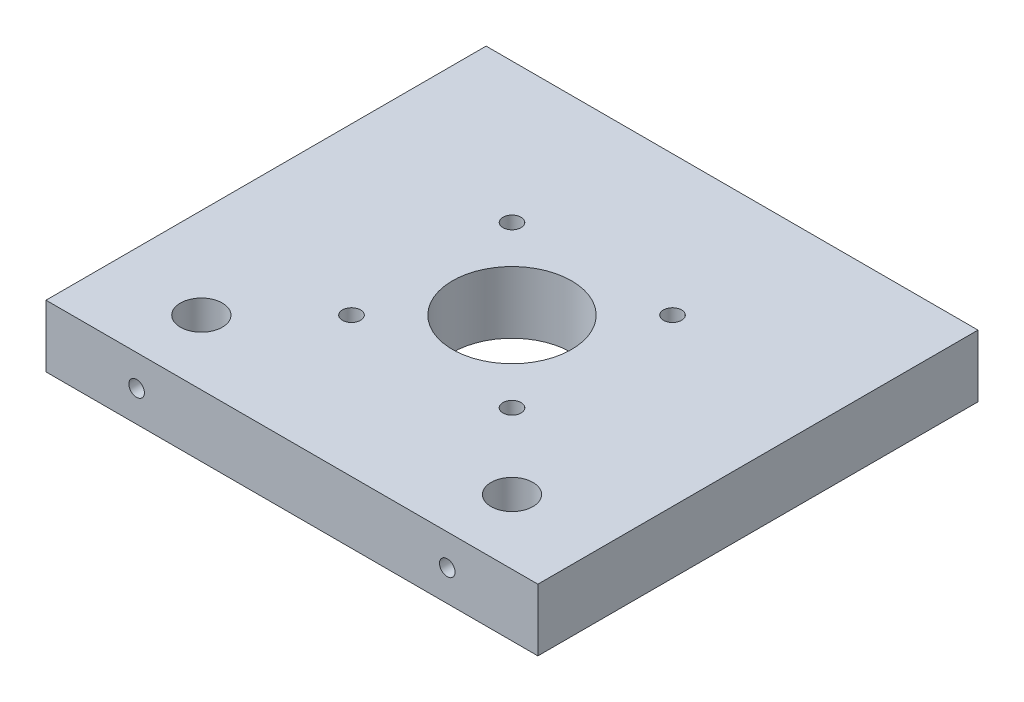
ISO-10303-21;
HEADER;
FILE_DESCRIPTION(('STEP AP214'),'2;1');
FILE_NAME('part.step','',(''),(''),'','','');
FILE_SCHEMA(('AUTOMOTIVE_DESIGN { 1 0 10303 214 1 1 1 1 }'));
ENDSEC;
DATA;
#1=APPLICATION_CONTEXT('core data for automotive mechanical design processes');
#2=APPLICATION_PROTOCOL_DEFINITION('international standard','automotive_design',2000,#1);
#3=PRODUCT_CONTEXT('',#1,'mechanical');
#4=PRODUCT('Part','Part','',(#3));
#5=PRODUCT_RELATED_PRODUCT_CATEGORY('part','',(#4));
#6=PRODUCT_DEFINITION_FORMATION('','',#4);
#7=PRODUCT_DEFINITION_CONTEXT('part definition',#1,'design');
#8=PRODUCT_DEFINITION('design','',#6,#7);
#9=PRODUCT_DEFINITION_SHAPE('','',#8);
#10=(LENGTH_UNIT() NAMED_UNIT(*) SI_UNIT(.MILLI.,.METRE.));
#11=(NAMED_UNIT(*) PLANE_ANGLE_UNIT() SI_UNIT($,.RADIAN.));
#12=(NAMED_UNIT(*) SI_UNIT($,.STERADIAN.) SOLID_ANGLE_UNIT());
#13=UNCERTAINTY_MEASURE_WITH_UNIT(LENGTH_MEASURE(1.E-05),#10,'distance_accuracy_value','');
#14=(GEOMETRIC_REPRESENTATION_CONTEXT(3) GLOBAL_UNCERTAINTY_ASSIGNED_CONTEXT((#13)) GLOBAL_UNIT_ASSIGNED_CONTEXT((#10,
#11,#12)) REPRESENTATION_CONTEXT('',''));
#15=CARTESIAN_POINT('',(0.,0.,0.));
#16=DIRECTION('',(0.,0.,1.));
#17=DIRECTION('',(1.,0.,0.));
#18=AXIS2_PLACEMENT_3D('',#15,#16,#17);
#19=CARTESIAN_POINT('',(47.5,6.,85.));
#20=DIRECTION('',(-1.,0.,0.));
#21=DIRECTION('',(0.,0.,1.));
#22=AXIS2_PLACEMENT_3D('',#19,#20,#21);
#23=PLANE('',#22);
#24=DIRECTION('',(0.,1.,0.));
#25=VECTOR('',#24,1.);
#26=CARTESIAN_POINT('',(47.5,6.,0.));
#27=LINE('',#26,#25);
#28=CARTESIAN_POINT('',(47.5,-6.,0.));
#29=VERTEX_POINT('',#28);
#30=CARTESIAN_POINT('',(47.5,6.,0.));
#31=VERTEX_POINT('',#30);
#32=EDGE_CURVE('E96',#29,#31,#27,.T.);
#33=ORIENTED_EDGE('',*,*,#32,.T.);
#34=DIRECTION('',(0.,0.,-1.));
#35=VECTOR('',#34,1.);
#36=CARTESIAN_POINT('',(47.5,6.,85.));
#37=LINE('',#36,#35);
#38=CARTESIAN_POINT('',(47.5,6.,85.));
#39=VERTEX_POINT('',#38);
#40=EDGE_CURVE('E11',#39,#31,#37,.T.);
#41=ORIENTED_EDGE('',*,*,#40,.F.);
#42=DIRECTION('',(0.,1.,0.));
#43=VECTOR('',#42,1.);
#44=CARTESIAN_POINT('',(47.5,6.,85.));
#45=LINE('',#44,#43);
#46=CARTESIAN_POINT('',(47.5,-6.,85.));
#47=VERTEX_POINT('',#46);
#48=EDGE_CURVE('E84',#47,#39,#45,.T.);
#49=ORIENTED_EDGE('',*,*,#48,.F.);
#50=DIRECTION('',(0.,0.,-1.));
#51=VECTOR('',#50,1.);
#52=CARTESIAN_POINT('',(47.5,-6.,85.));
#53=LINE('',#52,#51);
#54=EDGE_CURVE('E92',#47,#29,#53,.T.);
#55=ORIENTED_EDGE('',*,*,#54,.T.);
#56=EDGE_LOOP('',(#33,#41,#49,#55));
#57=FACE_BOUND('',#56,.T.);
#58=ADVANCED_FACE('F33',(#57),#23,.F.);
#59=CARTESIAN_POINT('',(-47.5,6.,85.));
#60=DIRECTION('',(0.,-1.,0.));
#61=DIRECTION('',(0.,0.,-1.));
#62=AXIS2_PLACEMENT_3D('',#59,#60,#61);
#63=PLANE('',#62);
#64=CARTESIAN_POINT('',(15.5,6.,27.));
#65=DIRECTION('',(0.,-1.,0.));
#66=DIRECTION('',(0.,0.,-1.));
#67=AXIS2_PLACEMENT_3D('',#64,#65,#66);
#68=CIRCLE('',#67,1.75);
#69=CARTESIAN_POINT('',(15.5,6.,25.25));
#70=VERTEX_POINT('',#69);
#71=EDGE_CURVE('E173',#70,#70,#68,.T.);
#72=ORIENTED_EDGE('',*,*,#71,.T.);
#73=EDGE_LOOP('',(#72));
#74=FACE_BOUND('',#73,.T.);
#75=CARTESIAN_POINT('',(15.5,6.,58.));
#76=DIRECTION('',(0.,-1.,0.));
#77=DIRECTION('',(0.,0.,-1.));
#78=AXIS2_PLACEMENT_3D('',#75,#76,#77);
#79=CIRCLE('',#78,1.75);
#80=CARTESIAN_POINT('',(15.5,6.,56.25));
#81=VERTEX_POINT('',#80);
#82=EDGE_CURVE('E167',#81,#81,#79,.T.);
#83=ORIENTED_EDGE('',*,*,#82,.T.);
#84=EDGE_LOOP('',(#83));
#85=FACE_BOUND('',#84,.T.);
#86=CARTESIAN_POINT('',(-15.5,6.,27.));
#87=DIRECTION('',(0.,-1.,0.));
#88=DIRECTION('',(0.,0.,-1.));
#89=AXIS2_PLACEMENT_3D('',#86,#87,#88);
#90=CIRCLE('',#89,1.75);
#91=CARTESIAN_POINT('',(-15.5,6.,25.25));
#92=VERTEX_POINT('',#91);
#93=EDGE_CURVE('E161',#92,#92,#90,.T.);
#94=ORIENTED_EDGE('',*,*,#93,.T.);
#95=EDGE_LOOP('',(#94));
#96=FACE_BOUND('',#95,.T.);
#97=CARTESIAN_POINT('',(-15.5,6.,58.));
#98=DIRECTION('',(0.,-1.,0.));
#99=DIRECTION('',(0.,0.,-1.));
#100=AXIS2_PLACEMENT_3D('',#97,#98,#99);
#101=CIRCLE('',#100,1.75);
#102=CARTESIAN_POINT('',(-15.5,6.,56.25));
#103=VERTEX_POINT('',#102);
#104=EDGE_CURVE('E157',#103,#103,#101,.T.);
#105=ORIENTED_EDGE('',*,*,#104,.T.);
#106=EDGE_LOOP('',(#105));
#107=FACE_BOUND('',#106,.T.);
#108=CARTESIAN_POINT('',(0.,6.,42.5));
#109=DIRECTION('',(0.,-1.,0.));
#110=DIRECTION('',(0.,0.,-1.));
#111=AXIS2_PLACEMENT_3D('',#108,#109,#110);
#112=CIRCLE('',#111,11.5);
#113=CARTESIAN_POINT('',(0.,6.,31.));
#114=VERTEX_POINT('',#113);
#115=EDGE_CURVE('E119',#114,#114,#112,.T.);
#116=ORIENTED_EDGE('',*,*,#115,.T.);
#117=EDGE_LOOP('',(#116));
#118=FACE_BOUND('',#117,.T.);
#119=CARTESIAN_POINT('',(30.,6.,72.5));
#120=DIRECTION('',(0.,-1.,0.));
#121=DIRECTION('',(0.,0.,-1.));
#122=AXIS2_PLACEMENT_3D('',#119,#120,#121);
#123=CIRCLE('',#122,4.05);
#124=CARTESIAN_POINT('',(30.,6.,68.45));
#125=VERTEX_POINT('',#124);
#126=EDGE_CURVE('E113',#125,#125,#123,.T.);
#127=ORIENTED_EDGE('',*,*,#126,.T.);
#128=EDGE_LOOP('',(#127));
#129=FACE_BOUND('',#128,.T.);
#130=CARTESIAN_POINT('',(-30.,6.,72.5));
#131=DIRECTION('',(0.,-1.,0.));
#132=DIRECTION('',(0.,0.,-1.));
#133=AXIS2_PLACEMENT_3D('',#130,#131,#132);
#134=CIRCLE('',#133,4.05);
#135=CARTESIAN_POINT('',(-30.,6.,68.45));
#136=VERTEX_POINT('',#135);
#137=EDGE_CURVE('E99',#136,#136,#134,.T.);
#138=ORIENTED_EDGE('',*,*,#137,.T.);
#139=EDGE_LOOP('',(#138));
#140=FACE_BOUND('',#139,.T.);
#141=DIRECTION('',(-1.,0.,0.));
#142=VECTOR('',#141,1.);
#143=CARTESIAN_POINT('',(-47.5,6.,0.));
#144=LINE('',#143,#142);
#145=CARTESIAN_POINT('',(-47.5,6.,0.));
#146=VERTEX_POINT('',#145);
#147=EDGE_CURVE('E88',#31,#146,#144,.T.);
#148=ORIENTED_EDGE('',*,*,#147,.T.);
#149=DIRECTION('',(0.,0.,-1.));
#150=VECTOR('',#149,1.);
#151=CARTESIAN_POINT('',(-47.5,6.,85.));
#152=LINE('',#151,#150);
#153=CARTESIAN_POINT('',(-47.5,6.,85.));
#154=VERTEX_POINT('',#153);
#155=EDGE_CURVE('E41',#154,#146,#152,.T.);
#156=ORIENTED_EDGE('',*,*,#155,.F.);
#157=DIRECTION('',(-1.,0.,0.));
#158=VECTOR('',#157,1.);
#159=CARTESIAN_POINT('',(-47.5,6.,85.));
#160=LINE('',#159,#158);
#161=EDGE_CURVE('E79',#39,#154,#160,.T.);
#162=ORIENTED_EDGE('',*,*,#161,.F.);
#163=ORIENTED_EDGE('',*,*,#40,.T.);
#164=EDGE_LOOP('',(#148,#156,#162,#163));
#165=FACE_BOUND('',#164,.T.);
#166=ADVANCED_FACE('F87',(#74,#85,#96,#107,#118,#129,#140,#165),#63,.F.);
#167=CARTESIAN_POINT('',(-47.5,6.,85.));
#168=DIRECTION('',(1.,0.,0.));
#169=DIRECTION('',(0.,1.,0.));
#170=AXIS2_PLACEMENT_3D('',#167,#168,#169);
#171=PLANE('',#170);
#172=DIRECTION('',(0.,-1.,0.));
#173=VECTOR('',#172,1.);
#174=CARTESIAN_POINT('',(-47.5,6.,0.));
#175=LINE('',#174,#173);
#176=CARTESIAN_POINT('',(-47.5,-6.,0.));
#177=VERTEX_POINT('',#176);
#178=EDGE_CURVE('E66',#146,#177,#175,.T.);
#179=ORIENTED_EDGE('',*,*,#178,.T.);
#180=DIRECTION('',(0.,0.,-1.));
#181=VECTOR('',#180,1.);
#182=CARTESIAN_POINT('',(-47.5,-6.,85.));
#183=LINE('',#182,#181);
#184=CARTESIAN_POINT('',(-47.5,-6.,85.));
#185=VERTEX_POINT('',#184);
#186=EDGE_CURVE('E89',#185,#177,#183,.T.);
#187=ORIENTED_EDGE('',*,*,#186,.F.);
#188=DIRECTION('',(0.,-1.,0.));
#189=VECTOR('',#188,1.);
#190=CARTESIAN_POINT('',(-47.5,6.,85.));
#191=LINE('',#190,#189);
#192=EDGE_CURVE('E82',#154,#185,#191,.T.);
#193=ORIENTED_EDGE('',*,*,#192,.F.);
#194=ORIENTED_EDGE('',*,*,#155,.T.);
#195=EDGE_LOOP('',(#179,#187,#193,#194));
#196=FACE_BOUND('',#195,.T.);
#197=ADVANCED_FACE('F90',(#196),#171,.F.);
#198=CARTESIAN_POINT('',(-47.5,-6.,85.));
#199=DIRECTION('',(0.,1.,0.));
#200=DIRECTION('',(0.,0.,1.));
#201=AXIS2_PLACEMENT_3D('',#198,#199,#200);
#202=PLANE('',#201);
#203=CARTESIAN_POINT('',(15.5,-6.,27.));
#204=DIRECTION('',(0.,-1.,0.));
#205=DIRECTION('',(0.,0.,-1.));
#206=AXIS2_PLACEMENT_3D('',#203,#204,#205);
#207=CIRCLE('',#206,1.75);
#208=CARTESIAN_POINT('',(15.5,-6.,25.25));
#209=VERTEX_POINT('',#208);
#210=EDGE_CURVE('E176',#209,#209,#207,.T.);
#211=ORIENTED_EDGE('',*,*,#210,.F.);
#212=EDGE_LOOP('',(#211));
#213=FACE_BOUND('',#212,.T.);
#214=CARTESIAN_POINT('',(15.5,-6.,58.));
#215=DIRECTION('',(0.,-1.,0.));
#216=DIRECTION('',(0.,0.,-1.));
#217=AXIS2_PLACEMENT_3D('',#214,#215,#216);
#218=CIRCLE('',#217,1.75);
#219=CARTESIAN_POINT('',(15.5,-6.,56.25));
#220=VERTEX_POINT('',#219);
#221=EDGE_CURVE('E170',#220,#220,#218,.T.);
#222=ORIENTED_EDGE('',*,*,#221,.F.);
#223=EDGE_LOOP('',(#222));
#224=FACE_BOUND('',#223,.T.);
#225=CARTESIAN_POINT('',(-15.5,-6.,27.));
#226=DIRECTION('',(0.,-1.,0.));
#227=DIRECTION('',(0.,0.,-1.));
#228=AXIS2_PLACEMENT_3D('',#225,#226,#227);
#229=CIRCLE('',#228,1.75);
#230=CARTESIAN_POINT('',(-15.5,-6.,25.25));
#231=VERTEX_POINT('',#230);
#232=EDGE_CURVE('E164',#231,#231,#229,.T.);
#233=ORIENTED_EDGE('',*,*,#232,.F.);
#234=EDGE_LOOP('',(#233));
#235=FACE_BOUND('',#234,.T.);
#236=CARTESIAN_POINT('',(-15.5,-6.,58.));
#237=DIRECTION('',(0.,-1.,0.));
#238=DIRECTION('',(0.,0.,-1.));
#239=AXIS2_PLACEMENT_3D('',#236,#237,#238);
#240=CIRCLE('',#239,1.75);
#241=CARTESIAN_POINT('',(-15.5,-6.,56.25));
#242=VERTEX_POINT('',#241);
#243=EDGE_CURVE('E158',#242,#242,#240,.T.);
#244=ORIENTED_EDGE('',*,*,#243,.F.);
#245=EDGE_LOOP('',(#244));
#246=FACE_BOUND('',#245,.T.);
#247=CARTESIAN_POINT('',(0.,-6.,42.5));
#248=DIRECTION('',(0.,-1.,0.));
#249=DIRECTION('',(0.,0.,-1.));
#250=AXIS2_PLACEMENT_3D('',#247,#248,#249);
#251=CIRCLE('',#250,11.5);
#252=CARTESIAN_POINT('',(0.,-6.,31.));
#253=VERTEX_POINT('',#252);
#254=EDGE_CURVE('E122',#253,#253,#251,.T.);
#255=ORIENTED_EDGE('',*,*,#254,.F.);
#256=EDGE_LOOP('',(#255));
#257=FACE_BOUND('',#256,.T.);
#258=CARTESIAN_POINT('',(30.,-6.,72.5));
#259=DIRECTION('',(0.,-1.,0.));
#260=DIRECTION('',(0.,0.,-1.));
#261=AXIS2_PLACEMENT_3D('',#258,#259,#260);
#262=CIRCLE('',#261,4.05);
#263=CARTESIAN_POINT('',(30.,-6.,68.45));
#264=VERTEX_POINT('',#263);
#265=EDGE_CURVE('E116',#264,#264,#262,.T.);
#266=ORIENTED_EDGE('',*,*,#265,.F.);
#267=EDGE_LOOP('',(#266));
#268=FACE_BOUND('',#267,.T.);
#269=CARTESIAN_POINT('',(-30.,-6.,72.5));
#270=DIRECTION('',(0.,-1.,0.));
#271=DIRECTION('',(0.,0.,-1.));
#272=AXIS2_PLACEMENT_3D('',#269,#270,#271);
#273=CIRCLE('',#272,4.05);
#274=CARTESIAN_POINT('',(-30.,-6.,68.45));
#275=VERTEX_POINT('',#274);
#276=EDGE_CURVE('E110',#275,#275,#273,.T.);
#277=ORIENTED_EDGE('',*,*,#276,.F.);
#278=EDGE_LOOP('',(#277));
#279=FACE_BOUND('',#278,.T.);
#280=DIRECTION('',(1.,0.,0.));
#281=VECTOR('',#280,1.);
#282=CARTESIAN_POINT('',(-47.5,-6.,0.));
#283=LINE('',#282,#281);
#284=EDGE_CURVE('E72',#177,#29,#283,.T.);
#285=ORIENTED_EDGE('',*,*,#284,.T.);
#286=ORIENTED_EDGE('',*,*,#54,.F.);
#287=DIRECTION('',(1.,0.,0.));
#288=VECTOR('',#287,1.);
#289=CARTESIAN_POINT('',(-47.5,-6.,85.));
#290=LINE('',#289,#288);
#291=EDGE_CURVE('E49',#185,#47,#290,.T.);
#292=ORIENTED_EDGE('',*,*,#291,.F.);
#293=ORIENTED_EDGE('',*,*,#186,.T.);
#294=EDGE_LOOP('',(#285,#286,#292,#293));
#295=FACE_BOUND('',#294,.T.);
#296=ADVANCED_FACE('F104',(#213,#224,#235,#246,#257,#268,#279,#295),#202,.F.);
#297=CARTESIAN_POINT('',(0.,0.,85.));
#298=DIRECTION('',(0.,0.,1.));
#299=DIRECTION('',(1.,0.,0.));
#300=AXIS2_PLACEMENT_3D('',#297,#298,#299);
#301=PLANE('',#300);
#302=CARTESIAN_POINT('',(-30.,0.,85.));
#303=DIRECTION('',(0.,0.,1.));
#304=DIRECTION('',(1.,0.,0.));
#305=AXIS2_PLACEMENT_3D('',#302,#303,#304);
#306=CIRCLE('',#305,1.5);
#307=CARTESIAN_POINT('',(-28.5,0.,85.));
#308=VERTEX_POINT('',#307);
#309=EDGE_CURVE('E137',#308,#308,#306,.T.);
#310=ORIENTED_EDGE('',*,*,#309,.F.);
#311=EDGE_LOOP('',(#310));
#312=FACE_BOUND('',#311,.T.);
#313=CARTESIAN_POINT('',(30.,0.,85.));
#314=DIRECTION('',(0.,0.,1.));
#315=DIRECTION('',(1.,0.,0.));
#316=AXIS2_PLACEMENT_3D('',#313,#314,#315);
#317=CIRCLE('',#316,1.5);
#318=CARTESIAN_POINT('',(31.5,0.,85.));
#319=VERTEX_POINT('',#318);
#320=EDGE_CURVE('E125',#319,#319,#317,.T.);
#321=ORIENTED_EDGE('',*,*,#320,.F.);
#322=EDGE_LOOP('',(#321));
#323=FACE_BOUND('',#322,.T.);
#324=ORIENTED_EDGE('',*,*,#48,.T.);
#325=ORIENTED_EDGE('',*,*,#161,.T.);
#326=ORIENTED_EDGE('',*,*,#192,.T.);
#327=ORIENTED_EDGE('',*,*,#291,.T.);
#328=EDGE_LOOP('',(#324,#325,#326,#327));
#329=FACE_BOUND('',#328,.T.);
#330=ADVANCED_FACE('F80',(#312,#323,#329),#301,.T.);
#331=CARTESIAN_POINT('',(0.,0.,0.));
#332=DIRECTION('',(0.,0.,1.));
#333=DIRECTION('',(1.,0.,0.));
#334=AXIS2_PLACEMENT_3D('',#331,#332,#333);
#335=PLANE('',#334);
#336=ORIENTED_EDGE('',*,*,#32,.F.);
#337=ORIENTED_EDGE('',*,*,#284,.F.);
#338=ORIENTED_EDGE('',*,*,#178,.F.);
#339=ORIENTED_EDGE('',*,*,#147,.F.);
#340=EDGE_LOOP('',(#336,#337,#338,#339));
#341=FACE_BOUND('',#340,.T.);
#342=ADVANCED_FACE('F107',(#341),#335,.F.);
#343=CARTESIAN_POINT('',(-30.,6.,72.5));
#344=DIRECTION('',(0.,-1.,0.));
#345=DIRECTION('',(0.,0.,-1.));
#346=AXIS2_PLACEMENT_3D('',#343,#344,#345);
#347=CYLINDRICAL_SURFACE('',#346,4.05);
#348=CARTESIAN_POINT('',(-28.5,0.,76.2619808611953));
#349=CARTESIAN_POINT('',(-28.499997314737,-0.0810891334683263,76.2619783928045));
#350=CARTESIAN_POINT('',(-28.5065973592327,-0.162160309047721,76.2646311539495));
#351=CARTESIAN_POINT('',(-28.5327065737687,-0.321863243037455,76.274883341602));
#352=CARTESIAN_POINT('',(-28.5522156126098,-0.400495026231791,76.2824827178351));
#353=CARTESIAN_POINT('',(-28.6033328710849,-0.552970015146571,76.3016517492077));
#354=CARTESIAN_POINT('',(-28.6349127361642,-0.626823972244057,76.3132120934298));
#355=CARTESIAN_POINT('',(-28.7091751195573,-0.768213906906506,76.3389856745783));
#356=CARTESIAN_POINT('',(-28.7518608833474,-0.835748029769575,76.3531996866424));
#357=CARTESIAN_POINT('',(-28.8493389051183,-0.965853976219434,76.3834508721137));
#358=CARTESIAN_POINT('',(-28.9045816891257,-1.02807608539166,76.3995407791495));
#359=CARTESIAN_POINT('',(-29.0246490643916,-1.14261844136584,76.4312902576168));
#360=CARTESIAN_POINT('',(-29.089475630863,-1.19493664189611,76.4469497395469));
#361=CARTESIAN_POINT('',(-29.2295135857313,-1.28985913712174,76.4766988909703));
#362=CARTESIAN_POINT('',(-29.3049975451178,-1.33208488813537,76.4907195036974));
#363=CARTESIAN_POINT('',(-29.4626083653082,-1.40309423078099,76.5149787680496));
#364=CARTESIAN_POINT('',(-29.5447329720443,-1.43188236132632,76.5252186964565));
#365=CARTESIAN_POINT('',(-29.709618342132,-1.47397749136628,76.5403885855827));
#366=CARTESIAN_POINT('',(-29.792206189695,-1.48788621560969,76.545524285012));
#367=CARTESIAN_POINT('',(-29.9586927605687,-1.50175400860525,76.5506444800488));
#368=CARTESIAN_POINT('',(-30.0425910595962,-1.50171750246429,76.5506306097202));
#369=CARTESIAN_POINT('',(-30.2050102957497,-1.48804993868762,76.5455850984626));
#370=CARTESIAN_POINT('',(-30.2835952941982,-1.47507528246144,76.5407957372615));
#371=CARTESIAN_POINT('',(-30.4373815523277,-1.43700170605454,76.5270535664788));
#372=CARTESIAN_POINT('',(-30.5125825727121,-1.41190192991977,76.518100462966));
#373=CARTESIAN_POINT('',(-30.6587528013293,-1.34997692309171,76.4967591559646));
#374=CARTESIAN_POINT('',(-30.7296453075566,-1.31298775789584,76.4843232590446));
#375=CARTESIAN_POINT('',(-30.8643913706546,-1.22847777825054,76.4572790398247));
#376=CARTESIAN_POINT('',(-30.9282426783346,-1.1809536130839,76.44267002684));
#377=CARTESIAN_POINT('',(-31.0509658559265,-1.0735427882489,76.4118029818039));
#378=CARTESIAN_POINT('',(-31.1093439009455,-1.01310443474047,76.3954984243782));
#379=CARTESIAN_POINT('',(-31.2153190318627,-0.883192548762243,76.3637503957587));
#380=CARTESIAN_POINT('',(-31.2629135453125,-0.813716866615781,76.34830713069));
#381=CARTESIAN_POINT('',(-31.3468823649577,-0.665799377193902,76.3197412833271));
#382=CARTESIAN_POINT('',(-31.3829975968804,-0.587198797366458,76.3066747987483));
#383=CARTESIAN_POINT('',(-31.4412945922282,-0.424420518637647,76.2849899492638));
#384=CARTESIAN_POINT('',(-31.4634838805418,-0.340245858924454,76.2763691825625));
#385=CARTESIAN_POINT('',(-31.4921896715132,-0.173578841001167,76.2651157106558));
#386=CARTESIAN_POINT('',(-31.4994885862334,-0.0912415305431188,76.2621844890466));
#387=CARTESIAN_POINT('',(-31.500459045415,0.0735155840518162,76.261798113694));
#388=CARTESIAN_POINT('',(-31.4941338764604,0.155935363500273,76.2643416392585));
#389=CARTESIAN_POINT('',(-31.4687444769862,0.314559610163147,76.2743156093745));
#390=CARTESIAN_POINT('',(-31.4502776486839,0.390875782779827,76.2815166342019));
#391=CARTESIAN_POINT('',(-31.4018766861181,0.539293906964582,76.2997244024622));
#392=CARTESIAN_POINT('',(-31.3719402375325,0.611395004635053,76.3107319139182));
#393=CARTESIAN_POINT('',(-31.3002061083661,0.752291982132171,76.3358121007634));
#394=CARTESIAN_POINT('',(-31.2580117406083,0.820867931809038,76.349982838958));
#395=CARTESIAN_POINT('',(-31.1633846350649,0.950244598484322,76.379625145236));
#396=CARTESIAN_POINT('',(-31.1109482303549,1.01104251779841,76.395097178085));
#397=CARTESIAN_POINT('',(-30.9935041262148,1.12701834020833,76.4267499585512));
#398=CARTESIAN_POINT('',(-30.9279212370453,1.18161983983997,76.4429156982628));
#399=CARTESIAN_POINT('',(-30.7881263448793,1.2791078364043,76.4732185032708));
#400=CARTESIAN_POINT('',(-30.7139143631044,1.32199436214671,76.4873555735559));
#401=CARTESIAN_POINT('',(-30.5590612040618,1.39453528925229,76.5119902346205));
#402=CARTESIAN_POINT('',(-30.4784465196371,1.42424117740281,76.5225019504079));
#403=CARTESIAN_POINT('',(-30.3128876221761,1.46950903351663,76.538750451691));
#404=CARTESIAN_POINT('',(-30.2279454063983,1.48507746490673,76.5444894191124));
#405=CARTESIAN_POINT('',(-30.0613592363511,1.50094439553547,76.5503438740335));
#406=CARTESIAN_POINT('',(-29.9798032651369,1.50206271323805,76.5507612591996));
#407=CARTESIAN_POINT('',(-29.8177161458208,1.49109642243981,76.5467075806102));
#408=CARTESIAN_POINT('',(-29.7371848802896,1.47901334083151,76.5422370821941));
#409=CARTESIAN_POINT('',(-29.5813374302406,1.44256012810747,76.5290447970322));
#410=CARTESIAN_POINT('',(-29.5059434137686,1.41848319870074,76.5204246150346));
#411=CARTESIAN_POINT('',(-29.3602561138345,1.35901504434104,76.49983077314));
#412=CARTESIAN_POINT('',(-29.2899637976753,1.32362168058717,76.4878564793705));
#413=CARTESIAN_POINT('',(-29.1532777321977,1.24084974508667,76.4611378823322));
#414=CARTESIAN_POINT('',(-29.0871673462468,1.19303426784743,76.4462991530481));
#415=CARTESIAN_POINT('',(-28.9636535486168,1.08747024196811,76.4156790217677));
#416=CARTESIAN_POINT('',(-28.9062532263973,1.0297181842499,76.3998972880413));
#417=CARTESIAN_POINT('',(-28.7987697852893,0.902404373946857,76.3681841258712));
#418=CARTESIAN_POINT('',(-28.7492113873448,0.832389533485982,76.3522863604418));
#419=CARTESIAN_POINT('',(-28.6625500703115,0.684522213395976,76.3230651787182));
#420=CARTESIAN_POINT('',(-28.625447860883,0.606669287539778,76.3097419091177));
#421=CARTESIAN_POINT('',(-28.5639832947332,0.442478256521022,76.2870142870943));
#422=CARTESIAN_POINT('',(-28.5400865456618,0.355943875708578,76.2777552807865));
#423=CARTESIAN_POINT('',(-28.5081012456911,0.179597624019246,76.2652417806732));
#424=CARTESIAN_POINT('',(-28.5000029733191,0.0897878033445274,76.2619835943778));
#425=CARTESIAN_POINT('',(-28.5,0.,76.2619808611953));
#426=B_SPLINE_CURVE_WITH_KNOTS('',3,(#348,#349,#350,#351,#352,#353,#354,#355,#356,#357,#358,
#359,#360,#361,#362,#363,#364,#365,#366,#367,#368,#369,#370,#371,#372,#373,#374,#375,#376,#377,
#378,#379,#380,#381,#382,#383,#384,#385,#386,#387,#388,#389,#390,#391,#392,#393,#394,#395,#396,
#397,#398,#399,#400,#401,#402,#403,#404,#405,#406,#407,#408,#409,#410,#411,#412,#413,#414,#415,
#416,#417,#418,#419,#420,#421,#422,#423,#424,#425),.UNSPECIFIED.,.T.,.F.,(4,2,2,2,2,2,2,2,2,2,2,
2,2,2,2,2,2,2,2,2,2,2,2,2,2,2,2,2,2,2,2,2,2,2,2,2,2,2,4),(0.,0.24293326478076,0.485864060573544,
0.728227680714844,0.970662206472731,1.22377778926956,1.4769456119752,1.73848739194063,
1.99994076517857,2.25036705443976,2.50071387838224,2.73897448477361,2.9772519132621,
3.2189668748059,3.46075882576672,3.7163830436328,3.97206817747706,4.2331702628709,
4.49413113990898,4.74098468620363,4.9877786898459,5.2232568302116,5.45878251003317,
5.7029934628183,5.94729201048287,6.2066301998645,6.46596775147042,6.72428315168352,
6.98248039454194,7.22596012354545,7.46941169431969,7.70718414319924,7.94500155755304,
8.19270089795979,8.44048789297795,8.70095423176163,8.96143540744973,9.23059451546761,
9.49958794616568),.UNSPECIFIED.);
#427=CARTESIAN_POINT('',(-28.5,0.,76.2619808611953));
#428=VERTEX_POINT('',#427);
#429=EDGE_CURVE('E152',#428,#428,#426,.T.);
#430=ORIENTED_EDGE('',*,*,#429,.F.);
#431=EDGE_LOOP('',(#430));
#432=FACE_BOUND('',#431,.T.);
#433=ORIENTED_EDGE('',*,*,#137,.F.);
#434=EDGE_LOOP('',(#433));
#435=FACE_BOUND('',#434,.T.);
#436=ORIENTED_EDGE('',*,*,#276,.T.);
#437=EDGE_LOOP('',(#436));
#438=FACE_BOUND('',#437,.T.);
#439=ADVANCED_FACE('F206',(#432,#435,#438),#347,.F.);
#440=CARTESIAN_POINT('',(30.,6.,72.5));
#441=DIRECTION('',(0.,-1.,0.));
#442=DIRECTION('',(0.,0.,-1.));
#443=AXIS2_PLACEMENT_3D('',#440,#441,#442);
#444=CYLINDRICAL_SURFACE('',#443,4.05);
#445=CARTESIAN_POINT('',(31.5,0.,76.2619808611953));
#446=CARTESIAN_POINT('',(31.500002685263,-0.0810891334683268,76.2619783928045));
#447=CARTESIAN_POINT('',(31.4934026407673,-0.162160309047722,76.2646311539495));
#448=CARTESIAN_POINT('',(31.4672934262313,-0.321863243037456,76.274883341602));
#449=CARTESIAN_POINT('',(31.4477843873903,-0.400495026231791,76.2824827178351));
#450=CARTESIAN_POINT('',(31.3966671289151,-0.55297001514657,76.3016517492077));
#451=CARTESIAN_POINT('',(31.3650872638358,-0.626823972244056,76.3132120934298));
#452=CARTESIAN_POINT('',(31.2908248804427,-0.768213906906506,76.3389856745783));
#453=CARTESIAN_POINT('',(31.2481391166527,-0.835748029769575,76.3531996866424));
#454=CARTESIAN_POINT('',(31.1506610948817,-0.965853976219435,76.3834508721137));
#455=CARTESIAN_POINT('',(31.0954183108743,-1.02807608539166,76.3995407791495));
#456=CARTESIAN_POINT('',(30.9753509356084,-1.14261844136584,76.4312902576168));
#457=CARTESIAN_POINT('',(30.910524369137,-1.19493664189611,76.4469497395469));
#458=CARTESIAN_POINT('',(30.7704864142687,-1.28985913712174,76.4766988909703));
#459=CARTESIAN_POINT('',(30.6950024548822,-1.33208488813537,76.4907195036974));
#460=CARTESIAN_POINT('',(30.5373916346918,-1.40309423078099,76.5149787680496));
#461=CARTESIAN_POINT('',(30.4552670279557,-1.43188236132632,76.5252186964565));
#462=CARTESIAN_POINT('',(30.290381657868,-1.47397749136628,76.5403885855827));
#463=CARTESIAN_POINT('',(30.207793810305,-1.48788621560969,76.545524285012));
#464=CARTESIAN_POINT('',(30.0413072394313,-1.50175400860525,76.5506444800488));
#465=CARTESIAN_POINT('',(29.9574089404038,-1.50171750246429,76.5506306097202));
#466=CARTESIAN_POINT('',(29.7949897042503,-1.48804993868762,76.5455850984626));
#467=CARTESIAN_POINT('',(29.7164047058018,-1.47507528246144,76.5407957372615));
#468=CARTESIAN_POINT('',(29.5626184476724,-1.43700170605454,76.5270535664788));
#469=CARTESIAN_POINT('',(29.4874174272879,-1.41190192991976,76.518100462966));
#470=CARTESIAN_POINT('',(29.3412471986707,-1.34997692309171,76.4967591559646));
#471=CARTESIAN_POINT('',(29.2703546924434,-1.31298775789584,76.4843232590446));
#472=CARTESIAN_POINT('',(29.1356086293454,-1.22847777825054,76.4572790398247));
#473=CARTESIAN_POINT('',(29.0717573216654,-1.1809536130839,76.44267002684));
#474=CARTESIAN_POINT('',(28.9490341440735,-1.0735427882489,76.4118029818039));
#475=CARTESIAN_POINT('',(28.8906560990545,-1.01310443474047,76.3954984243782));
#476=CARTESIAN_POINT('',(28.7846809681373,-0.883192548762241,76.3637503957587));
#477=CARTESIAN_POINT('',(28.7370864546875,-0.81371686661578,76.34830713069));
#478=CARTESIAN_POINT('',(28.6531176350423,-0.665799377193902,76.319741283327));
#479=CARTESIAN_POINT('',(28.6170024031196,-0.587198797366458,76.3066747987483));
#480=CARTESIAN_POINT('',(28.5587054077718,-0.424420518637647,76.2849899492638));
#481=CARTESIAN_POINT('',(28.5365161194582,-0.340245858924453,76.2763691825625));
#482=CARTESIAN_POINT('',(28.5078103284869,-0.173578841001165,76.2651157106558));
#483=CARTESIAN_POINT('',(28.5005114137666,-0.0912415305431178,76.2621844890466));
#484=CARTESIAN_POINT('',(28.499540954585,0.0735155840518159,76.261798113694));
#485=CARTESIAN_POINT('',(28.5058661235396,0.155935363500272,76.2643416392585));
#486=CARTESIAN_POINT('',(28.5312555230138,0.314559610163145,76.2743156093744));
#487=CARTESIAN_POINT('',(28.5497223513161,0.390875782779824,76.2815166342019));
#488=CARTESIAN_POINT('',(28.5981233138819,0.539293906964579,76.2997244024622));
#489=CARTESIAN_POINT('',(28.6280597624675,0.61139500463505,76.3107319139182));
#490=CARTESIAN_POINT('',(28.6997938916339,0.752291982132168,76.3358121007634));
#491=CARTESIAN_POINT('',(28.7419882593917,0.820867931809036,76.3499828389579));
#492=CARTESIAN_POINT('',(28.8366153649351,0.95024459848432,76.379625145236));
#493=CARTESIAN_POINT('',(28.8890517696452,1.0110425177984,76.3950971780849));
#494=CARTESIAN_POINT('',(29.0064958737852,1.12701834020833,76.4267499585512));
#495=CARTESIAN_POINT('',(29.0720787629547,1.18161983983997,76.4429156982628));
#496=CARTESIAN_POINT('',(29.2118736551207,1.2791078364043,76.4732185032708));
#497=CARTESIAN_POINT('',(29.2860856368956,1.32199436214671,76.4873555735559));
#498=CARTESIAN_POINT('',(29.4409387959382,1.39453528925229,76.5119902346205));
#499=CARTESIAN_POINT('',(29.5215534803629,1.42424117740281,76.5225019504079));
#500=CARTESIAN_POINT('',(29.6871123778239,1.46950903351663,76.538750451691));
#501=CARTESIAN_POINT('',(29.7720545936017,1.48507746490673,76.5444894191124));
#502=CARTESIAN_POINT('',(29.9386407636489,1.50094439553547,76.5503438740335));
#503=CARTESIAN_POINT('',(30.0201967348631,1.50206271323805,76.5507612591996));
#504=CARTESIAN_POINT('',(30.1822838541792,1.49109642243981,76.5467075806102));
#505=CARTESIAN_POINT('',(30.2628151197104,1.47901334083151,76.5422370821941));
#506=CARTESIAN_POINT('',(30.4186625697594,1.44256012810747,76.5290447970322));
#507=CARTESIAN_POINT('',(30.4940565862314,1.41848319870074,76.5204246150346));
#508=CARTESIAN_POINT('',(30.6397438861655,1.35901504434104,76.49983077314));
#509=CARTESIAN_POINT('',(30.7100362023247,1.32362168058717,76.4878564793705));
#510=CARTESIAN_POINT('',(30.8467222678023,1.24084974508667,76.4611378823322));
#511=CARTESIAN_POINT('',(30.9128326537532,1.19303426784743,76.4462991530481));
#512=CARTESIAN_POINT('',(31.0363464513832,1.08747024196811,76.4156790217677));
#513=CARTESIAN_POINT('',(31.0937467736027,1.0297181842499,76.3998972880413));
#514=CARTESIAN_POINT('',(31.2012302147107,0.902404373946858,76.3681841258712));
#515=CARTESIAN_POINT('',(31.2507886126552,0.832389533485984,76.3522863604418));
#516=CARTESIAN_POINT('',(31.3374499296885,0.684522213395977,76.3230651787181));
#517=CARTESIAN_POINT('',(31.374552139117,0.606669287539778,76.3097419091177));
#518=CARTESIAN_POINT('',(31.4360167052668,0.442478256521022,76.2870142870943));
#519=CARTESIAN_POINT('',(31.4599134543382,0.355943875708578,76.2777552807865));
#520=CARTESIAN_POINT('',(31.4918987543089,0.179597624019247,76.2652417806732));
#521=CARTESIAN_POINT('',(31.4999970266809,0.0897878033445282,76.2619835943778));
#522=CARTESIAN_POINT('',(31.5,0.,76.2619808611953));
#523=B_SPLINE_CURVE_WITH_KNOTS('',3,(#445,#446,#447,#448,#449,#450,#451,#452,#453,#454,#455,
#456,#457,#458,#459,#460,#461,#462,#463,#464,#465,#466,#467,#468,#469,#470,#471,#472,#473,#474,
#475,#476,#477,#478,#479,#480,#481,#482,#483,#484,#485,#486,#487,#488,#489,#490,#491,#492,#493,
#494,#495,#496,#497,#498,#499,#500,#501,#502,#503,#504,#505,#506,#507,#508,#509,#510,#511,#512,
#513,#514,#515,#516,#517,#518,#519,#520,#521,#522),.UNSPECIFIED.,.T.,.F.,(4,2,2,2,2,2,2,2,2,2,2,
2,2,2,2,2,2,2,2,2,2,2,2,2,2,2,2,2,2,2,2,2,2,2,2,2,2,2,4),(0.,0.24293326478076,0.485864060573544,
0.728227680714843,0.970662206472731,1.22377778926956,1.4769456119752,1.73848739194063,
1.99994076517857,2.25036705443976,2.50071387838224,2.73897448477361,2.9772519132621,
3.2189668748059,3.46075882576672,3.7163830436328,3.97206817747706,4.2331702628709,
4.49413113990898,4.74098468620363,4.9877786898459,5.22325683021159,5.45878251003317,
5.70299346281829,5.94729201048287,6.20663019986451,6.46596775147041,6.72428315168352,
6.98248039454194,7.22596012354545,7.46941169431969,7.70718414319924,7.94500155755304,
8.19270089795979,8.44048789297795,8.70095423176163,8.96143540744973,9.23059451546761,
9.49958794616568),.UNSPECIFIED.);
#524=CARTESIAN_POINT('',(31.5,0.,76.2619808611953));
#525=VERTEX_POINT('',#524);
#526=EDGE_CURVE('E130',#525,#525,#523,.T.);
#527=ORIENTED_EDGE('',*,*,#526,.F.);
#528=EDGE_LOOP('',(#527));
#529=FACE_BOUND('',#528,.T.);
#530=ORIENTED_EDGE('',*,*,#126,.F.);
#531=EDGE_LOOP('',(#530));
#532=FACE_BOUND('',#531,.T.);
#533=ORIENTED_EDGE('',*,*,#265,.T.);
#534=EDGE_LOOP('',(#533));
#535=FACE_BOUND('',#534,.T.);
#536=ADVANCED_FACE('F208',(#529,#532,#535),#444,.F.);
#537=CARTESIAN_POINT('',(0.,6.,42.5));
#538=DIRECTION('',(0.,-1.,0.));
#539=DIRECTION('',(0.,0.,-1.));
#540=AXIS2_PLACEMENT_3D('',#537,#538,#539);
#541=CYLINDRICAL_SURFACE('',#540,11.5);
#542=ORIENTED_EDGE('',*,*,#115,.F.);
#543=EDGE_LOOP('',(#542));
#544=FACE_BOUND('',#543,.T.);
#545=ORIENTED_EDGE('',*,*,#254,.T.);
#546=EDGE_LOOP('',(#545));
#547=FACE_BOUND('',#546,.T.);
#548=ADVANCED_FACE('F215',(#544,#547),#541,.F.);
#549=CARTESIAN_POINT('',(30.,0.,-0.001000000000001));
#550=DIRECTION('',(0.,0.,1.));
#551=DIRECTION('',(1.,0.,0.));
#552=AXIS2_PLACEMENT_3D('',#549,#550,#551);
#553=CYLINDRICAL_SURFACE('',#552,1.5);
#554=ORIENTED_EDGE('',*,*,#320,.T.);
#555=EDGE_LOOP('',(#554));
#556=FACE_BOUND('',#555,.T.);
#557=ORIENTED_EDGE('',*,*,#526,.T.);
#558=EDGE_LOOP('',(#557));
#559=FACE_BOUND('',#558,.T.);
#560=ADVANCED_FACE('F139',(#556,#559),#553,.F.);
#561=CARTESIAN_POINT('',(-30.,0.,-0.001000000000001));
#562=DIRECTION('',(0.,0.,1.));
#563=DIRECTION('',(1.,0.,0.));
#564=AXIS2_PLACEMENT_3D('',#561,#562,#563);
#565=CYLINDRICAL_SURFACE('',#564,1.5);
#566=ORIENTED_EDGE('',*,*,#309,.T.);
#567=EDGE_LOOP('',(#566));
#568=FACE_BOUND('',#567,.T.);
#569=ORIENTED_EDGE('',*,*,#429,.T.);
#570=EDGE_LOOP('',(#569));
#571=FACE_BOUND('',#570,.T.);
#572=ADVANCED_FACE('F144',(#568,#571),#565,.F.);
#573=CARTESIAN_POINT('',(-15.5,6.,58.));
#574=DIRECTION('',(0.,-1.,0.));
#575=DIRECTION('',(0.,0.,-1.));
#576=AXIS2_PLACEMENT_3D('',#573,#574,#575);
#577=CYLINDRICAL_SURFACE('',#576,1.75);
#578=ORIENTED_EDGE('',*,*,#104,.F.);
#579=EDGE_LOOP('',(#578));
#580=FACE_BOUND('',#579,.T.);
#581=ORIENTED_EDGE('',*,*,#243,.T.);
#582=EDGE_LOOP('',(#581));
#583=FACE_BOUND('',#582,.T.);
#584=ADVANCED_FACE('F148',(#580,#583),#577,.F.);
#585=CARTESIAN_POINT('',(-15.5,6.,27.));
#586=DIRECTION('',(0.,-1.,0.));
#587=DIRECTION('',(0.,0.,-1.));
#588=AXIS2_PLACEMENT_3D('',#585,#586,#587);
#589=CYLINDRICAL_SURFACE('',#588,1.75);
#590=ORIENTED_EDGE('',*,*,#93,.F.);
#591=EDGE_LOOP('',(#590));
#592=FACE_BOUND('',#591,.T.);
#593=ORIENTED_EDGE('',*,*,#232,.T.);
#594=EDGE_LOOP('',(#593));
#595=FACE_BOUND('',#594,.T.);
#596=ADVANCED_FACE('F296',(#592,#595),#589,.F.);
#597=CARTESIAN_POINT('',(15.5,6.,58.));
#598=DIRECTION('',(0.,-1.,0.));
#599=DIRECTION('',(0.,0.,-1.));
#600=AXIS2_PLACEMENT_3D('',#597,#598,#599);
#601=CYLINDRICAL_SURFACE('',#600,1.75);
#602=ORIENTED_EDGE('',*,*,#82,.F.);
#603=EDGE_LOOP('',(#602));
#604=FACE_BOUND('',#603,.T.);
#605=ORIENTED_EDGE('',*,*,#221,.T.);
#606=EDGE_LOOP('',(#605));
#607=FACE_BOUND('',#606,.T.);
#608=ADVANCED_FACE('F187',(#604,#607),#601,.F.);
#609=CARTESIAN_POINT('',(15.5,6.,27.));
#610=DIRECTION('',(0.,-1.,0.));
#611=DIRECTION('',(0.,0.,-1.));
#612=AXIS2_PLACEMENT_3D('',#609,#610,#611);
#613=CYLINDRICAL_SURFACE('',#612,1.75);
#614=ORIENTED_EDGE('',*,*,#71,.F.);
#615=EDGE_LOOP('',(#614));
#616=FACE_BOUND('',#615,.T.);
#617=ORIENTED_EDGE('',*,*,#210,.T.);
#618=EDGE_LOOP('',(#617));
#619=FACE_BOUND('',#618,.T.);
#620=ADVANCED_FACE('F184',(#616,#619),#613,.F.);
#621=CLOSED_SHELL('',(#58,#166,#197,#296,#330,#342,#439,#536,#548,#560,#572,#584,#596,#608,#620));
#622=MANIFOLD_SOLID_BREP('B2',#621);
#623=ADVANCED_BREP_SHAPE_REPRESENTATION('',(#18,#622),#14);
#624=SHAPE_DEFINITION_REPRESENTATION(#9,#623);
ENDSEC;
END-ISO-10303-21;
